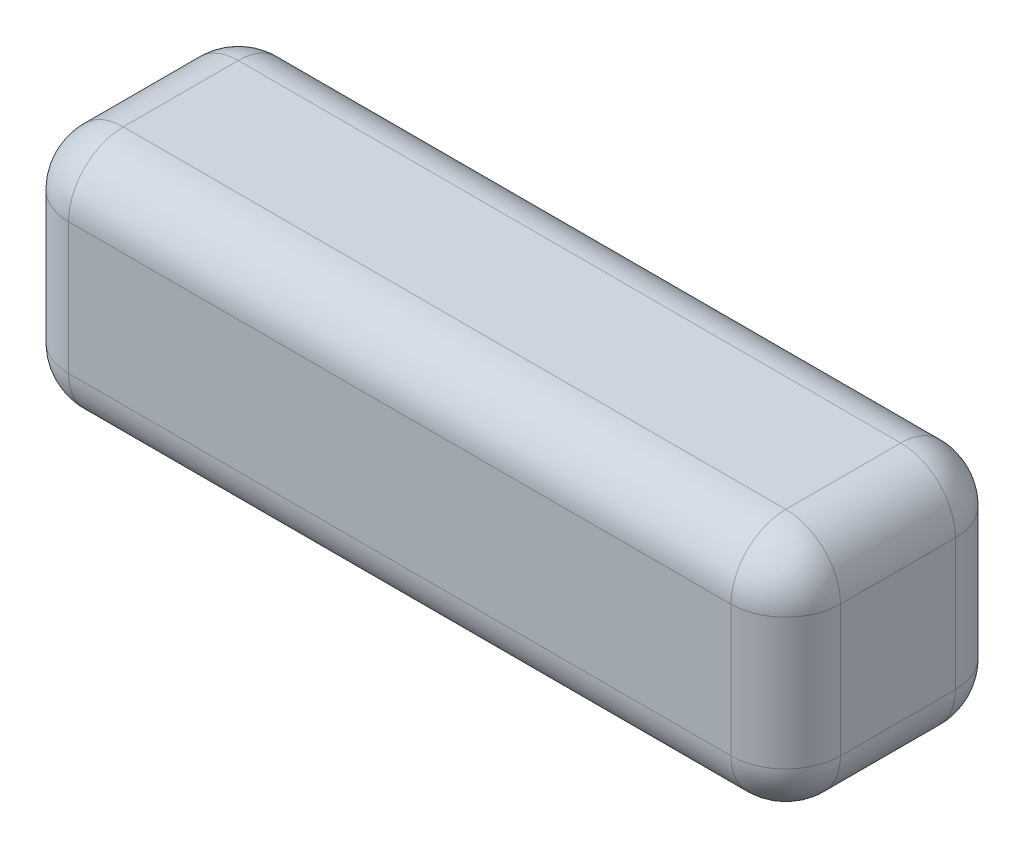
ISO-10303-21;
HEADER;
FILE_DESCRIPTION(('STEP AP214'),'2;1');
FILE_NAME('part.step','',(''),(''),'','','');
FILE_SCHEMA(('AUTOMOTIVE_DESIGN { 1 0 10303 214 1 1 1 1 }'));
ENDSEC;
DATA;
#1=APPLICATION_CONTEXT('core data for automotive mechanical design processes');
#2=APPLICATION_PROTOCOL_DEFINITION('international standard','automotive_design',2000,#1);
#3=PRODUCT_CONTEXT('',#1,'mechanical');
#4=PRODUCT('Part','Part','',(#3));
#5=PRODUCT_RELATED_PRODUCT_CATEGORY('part','',(#4));
#6=PRODUCT_DEFINITION_FORMATION('','',#4);
#7=PRODUCT_DEFINITION_CONTEXT('part definition',#1,'design');
#8=PRODUCT_DEFINITION('design','',#6,#7);
#9=PRODUCT_DEFINITION_SHAPE('','',#8);
#10=(LENGTH_UNIT() NAMED_UNIT(*) SI_UNIT(.MILLI.,.METRE.));
#11=(NAMED_UNIT(*) PLANE_ANGLE_UNIT() SI_UNIT($,.RADIAN.));
#12=(NAMED_UNIT(*) SI_UNIT($,.STERADIAN.) SOLID_ANGLE_UNIT());
#13=UNCERTAINTY_MEASURE_WITH_UNIT(LENGTH_MEASURE(1.E-05),#10,'distance_accuracy_value','');
#14=(GEOMETRIC_REPRESENTATION_CONTEXT(3) GLOBAL_UNCERTAINTY_ASSIGNED_CONTEXT((#13)) GLOBAL_UNIT_ASSIGNED_CONTEXT((#10,
#11,#12)) REPRESENTATION_CONTEXT('',''));
#15=CARTESIAN_POINT('',(0.,0.,0.));
#16=DIRECTION('',(0.,0.,1.));
#17=DIRECTION('',(1.,0.,0.));
#18=AXIS2_PLACEMENT_3D('',#15,#16,#17);
#19=CARTESIAN_POINT('',(-70.4999999999999,44.,-20.5));
#20=DIRECTION('',(1.,0.,0.));
#21=DIRECTION('',(0.,0.,-1.));
#22=AXIS2_PLACEMENT_3D('',#19,#20,#21);
#23=PLANE('',#22);
#24=DIRECTION('',(0.,-1.,0.));
#25=VECTOR('',#24,1.);
#26=CARTESIAN_POINT('',(-70.4999999999999,44.,10.5));
#27=LINE('',#26,#25);
#28=CARTESIAN_POINT('',(-70.4999999999999,10.,10.5));
#29=VERTEX_POINT('',#28);
#30=CARTESIAN_POINT('',(-70.4999999999999,34.,10.5));
#31=VERTEX_POINT('',#30);
#32=EDGE_CURVE('E136',#29,#31,#27,.F.);
#33=ORIENTED_EDGE('',*,*,#32,.T.);
#34=DIRECTION('',(0.,0.,1.));
#35=VECTOR('',#34,1.);
#36=CARTESIAN_POINT('',(-70.4999999999999,34.,-20.5));
#37=LINE('',#36,#35);
#38=CARTESIAN_POINT('',(-70.4999999999999,34.,-10.5));
#39=VERTEX_POINT('',#38);
#40=EDGE_CURVE('E173',#31,#39,#37,.F.);
#41=ORIENTED_EDGE('',*,*,#40,.T.);
#42=DIRECTION('',(0.,-1.,0.));
#43=VECTOR('',#42,1.);
#44=CARTESIAN_POINT('',(-70.4999999999999,44.,-10.5));
#45=LINE('',#44,#43);
#46=CARTESIAN_POINT('',(-70.4999999999999,10.,-10.5));
#47=VERTEX_POINT('',#46);
#48=EDGE_CURVE('E170',#39,#47,#45,.T.);
#49=ORIENTED_EDGE('',*,*,#48,.T.);
#50=DIRECTION('',(0.,0.,1.));
#51=VECTOR('',#50,1.);
#52=CARTESIAN_POINT('',(-70.4999999999999,10.,-20.5));
#53=LINE('',#52,#51);
#54=EDGE_CURVE('E165',#47,#29,#53,.T.);
#55=ORIENTED_EDGE('',*,*,#54,.T.);
#56=EDGE_LOOP('',(#33,#41,#49,#55));
#57=FACE_BOUND('',#56,.T.);
#58=ADVANCED_FACE('F41',(#57),#23,.F.);
#59=CARTESIAN_POINT('',(-70.4999999999999,44.,20.5));
#60=DIRECTION('',(0.,0.,-1.));
#61=DIRECTION('',(-1.,0.,0.));
#62=AXIS2_PLACEMENT_3D('',#59,#60,#61);
#63=PLANE('',#62);
#64=DIRECTION('',(0.,-1.,0.));
#65=VECTOR('',#64,1.);
#66=CARTESIAN_POINT('',(60.5000000000001,44.,20.5));
#67=LINE('',#66,#65);
#68=CARTESIAN_POINT('',(60.5000000000001,10.,20.5));
#69=VERTEX_POINT('',#68);
#70=CARTESIAN_POINT('',(60.5000000000001,34.,20.5));
#71=VERTEX_POINT('',#70);
#72=EDGE_CURVE('E158',#69,#71,#67,.F.);
#73=ORIENTED_EDGE('',*,*,#72,.T.);
#74=DIRECTION('',(1.,0.,0.));
#75=VECTOR('',#74,1.);
#76=CARTESIAN_POINT('',(-70.4999999999999,34.,20.5));
#77=LINE('',#76,#75);
#78=CARTESIAN_POINT('',(-60.4999999999999,34.,20.5));
#79=VERTEX_POINT('',#78);
#80=EDGE_CURVE('E162',#71,#79,#77,.F.);
#81=ORIENTED_EDGE('',*,*,#80,.T.);
#82=DIRECTION('',(0.,-1.,0.));
#83=VECTOR('',#82,1.);
#84=CARTESIAN_POINT('',(-60.4999999999999,44.,20.5));
#85=LINE('',#84,#83);
#86=CARTESIAN_POINT('',(-60.4999999999999,10.,20.5));
#87=VERTEX_POINT('',#86);
#88=EDGE_CURVE('E134',#79,#87,#85,.T.);
#89=ORIENTED_EDGE('',*,*,#88,.T.);
#90=DIRECTION('',(1.,0.,0.));
#91=VECTOR('',#90,1.);
#92=CARTESIAN_POINT('',(-70.4999999999999,10.,20.5));
#93=LINE('',#92,#91);
#94=EDGE_CURVE('E152',#87,#69,#93,.T.);
#95=ORIENTED_EDGE('',*,*,#94,.T.);
#96=EDGE_LOOP('',(#73,#81,#89,#95));
#97=FACE_BOUND('',#96,.T.);
#98=ADVANCED_FACE('F160',(#97),#63,.F.);
#99=CARTESIAN_POINT('',(70.5000000000001,44.,-20.5));
#100=DIRECTION('',(-1.,0.,0.));
#101=DIRECTION('',(0.,0.,1.));
#102=AXIS2_PLACEMENT_3D('',#99,#100,#101);
#103=PLANE('',#102);
#104=DIRECTION('',(0.,-1.,0.));
#105=VECTOR('',#104,1.);
#106=CARTESIAN_POINT('',(70.5000000000001,44.,-10.5));
#107=LINE('',#106,#105);
#108=CARTESIAN_POINT('',(70.5000000000001,10.,-10.5));
#109=VERTEX_POINT('',#108);
#110=CARTESIAN_POINT('',(70.5000000000001,34.,-10.5));
#111=VERTEX_POINT('',#110);
#112=EDGE_CURVE('E177',#109,#111,#107,.F.);
#113=ORIENTED_EDGE('',*,*,#112,.T.);
#114=DIRECTION('',(0.,0.,-1.));
#115=VECTOR('',#114,1.);
#116=CARTESIAN_POINT('',(70.5000000000001,34.,20.5));
#117=LINE('',#116,#115);
#118=CARTESIAN_POINT('',(70.5000000000001,34.,10.5));
#119=VERTEX_POINT('',#118);
#120=EDGE_CURVE('E182',#111,#119,#117,.F.);
#121=ORIENTED_EDGE('',*,*,#120,.T.);
#122=DIRECTION('',(0.,-1.,0.));
#123=VECTOR('',#122,1.);
#124=CARTESIAN_POINT('',(70.5000000000001,44.,10.5));
#125=LINE('',#124,#123);
#126=CARTESIAN_POINT('',(70.5000000000001,10.,10.5));
#127=VERTEX_POINT('',#126);
#128=EDGE_CURVE('E179',#119,#127,#125,.T.);
#129=ORIENTED_EDGE('',*,*,#128,.T.);
#130=DIRECTION('',(0.,0.,-1.));
#131=VECTOR('',#130,1.);
#132=CARTESIAN_POINT('',(70.5000000000001,10.,-20.5));
#133=LINE('',#132,#131);
#134=EDGE_CURVE('E175',#127,#109,#133,.T.);
#135=ORIENTED_EDGE('',*,*,#134,.T.);
#136=EDGE_LOOP('',(#113,#121,#129,#135));
#137=FACE_BOUND('',#136,.T.);
#138=ADVANCED_FACE('F287',(#137),#103,.F.);
#139=CARTESIAN_POINT('',(-70.4999999999999,44.,-20.5));
#140=DIRECTION('',(0.,0.,1.));
#141=DIRECTION('',(1.,0.,0.));
#142=AXIS2_PLACEMENT_3D('',#139,#140,#141);
#143=PLANE('',#142);
#144=DIRECTION('',(0.,-1.,0.));
#145=VECTOR('',#144,1.);
#146=CARTESIAN_POINT('',(-60.4999999999999,44.,-20.5));
#147=LINE('',#146,#145);
#148=CARTESIAN_POINT('',(-60.4999999999999,10.,-20.5));
#149=VERTEX_POINT('',#148);
#150=CARTESIAN_POINT('',(-60.4999999999999,34.,-20.5));
#151=VERTEX_POINT('',#150);
#152=EDGE_CURVE('E186',#149,#151,#147,.F.);
#153=ORIENTED_EDGE('',*,*,#152,.T.);
#154=DIRECTION('',(-1.,0.,0.));
#155=VECTOR('',#154,1.);
#156=CARTESIAN_POINT('',(70.5000000000001,34.,-20.5));
#157=LINE('',#156,#155);
#158=CARTESIAN_POINT('',(60.5000000000001,34.,-20.5));
#159=VERTEX_POINT('',#158);
#160=EDGE_CURVE('E191',#151,#159,#157,.F.);
#161=ORIENTED_EDGE('',*,*,#160,.T.);
#162=DIRECTION('',(0.,-1.,0.));
#163=VECTOR('',#162,1.);
#164=CARTESIAN_POINT('',(60.5000000000001,44.,-20.5));
#165=LINE('',#164,#163);
#166=CARTESIAN_POINT('',(60.5000000000001,10.,-20.5));
#167=VERTEX_POINT('',#166);
#168=EDGE_CURVE('E188',#159,#167,#165,.T.);
#169=ORIENTED_EDGE('',*,*,#168,.T.);
#170=DIRECTION('',(-1.,0.,0.));
#171=VECTOR('',#170,1.);
#172=CARTESIAN_POINT('',(-70.4999999999999,10.,-20.5));
#173=LINE('',#172,#171);
#174=EDGE_CURVE('E184',#167,#149,#173,.T.);
#175=ORIENTED_EDGE('',*,*,#174,.T.);
#176=EDGE_LOOP('',(#153,#161,#169,#175));
#177=FACE_BOUND('',#176,.T.);
#178=ADVANCED_FACE('F297',(#177),#143,.F.);
#179=CARTESIAN_POINT('',(0.,44.,0.));
#180=DIRECTION('',(0.,1.,0.));
#181=DIRECTION('',(0.,0.,1.));
#182=AXIS2_PLACEMENT_3D('',#179,#180,#181);
#183=PLANE('',#182);
#184=DIRECTION('',(0.,0.,-1.));
#185=VECTOR('',#184,1.);
#186=CARTESIAN_POINT('',(60.5000000000001,44.,-20.5));
#187=LINE('',#186,#185);
#188=CARTESIAN_POINT('',(60.5000000000001,44.,10.5));
#189=VERTEX_POINT('',#188);
#190=CARTESIAN_POINT('',(60.5000000000001,44.,-10.5));
#191=VERTEX_POINT('',#190);
#192=EDGE_CURVE('E197',#189,#191,#187,.T.);
#193=ORIENTED_EDGE('',*,*,#192,.T.);
#194=DIRECTION('',(-1.,0.,0.));
#195=VECTOR('',#194,1.);
#196=CARTESIAN_POINT('',(-70.4999999999999,44.,-10.5));
#197=LINE('',#196,#195);
#198=CARTESIAN_POINT('',(-60.4999999999999,44.,-10.5));
#199=VERTEX_POINT('',#198);
#200=EDGE_CURVE('E199',#191,#199,#197,.T.);
#201=ORIENTED_EDGE('',*,*,#200,.T.);
#202=DIRECTION('',(0.,0.,1.));
#203=VECTOR('',#202,1.);
#204=CARTESIAN_POINT('',(-60.4999999999999,44.,20.5));
#205=LINE('',#204,#203);
#206=CARTESIAN_POINT('',(-60.4999999999999,44.,10.5));
#207=VERTEX_POINT('',#206);
#208=EDGE_CURVE('E193',#199,#207,#205,.T.);
#209=ORIENTED_EDGE('',*,*,#208,.T.);
#210=DIRECTION('',(1.,0.,0.));
#211=VECTOR('',#210,1.);
#212=CARTESIAN_POINT('',(70.5000000000001,44.,10.5));
#213=LINE('',#212,#211);
#214=EDGE_CURVE('E195',#207,#189,#213,.T.);
#215=ORIENTED_EDGE('',*,*,#214,.T.);
#216=EDGE_LOOP('',(#193,#201,#209,#215));
#217=FACE_BOUND('',#216,.T.);
#218=ADVANCED_FACE('F279',(#217),#183,.T.);
#219=CARTESIAN_POINT('',(0.,0.,0.));
#220=DIRECTION('',(0.,1.,0.));
#221=DIRECTION('',(0.,0.,1.));
#222=AXIS2_PLACEMENT_3D('',#219,#220,#221);
#223=PLANE('',#222);
#224=DIRECTION('',(0.,0.,1.));
#225=VECTOR('',#224,1.);
#226=CARTESIAN_POINT('',(-60.4999999999999,0.,0.));
#227=LINE('',#226,#225);
#228=CARTESIAN_POINT('',(-60.4999999999999,0.,10.5));
#229=VERTEX_POINT('',#228);
#230=CARTESIAN_POINT('',(-60.4999999999999,0.,-10.5));
#231=VERTEX_POINT('',#230);
#232=EDGE_CURVE('E202',#229,#231,#227,.F.);
#233=ORIENTED_EDGE('',*,*,#232,.T.);
#234=DIRECTION('',(-1.,0.,0.));
#235=VECTOR('',#234,1.);
#236=CARTESIAN_POINT('',(0.,0.,-10.5));
#237=LINE('',#236,#235);
#238=CARTESIAN_POINT('',(60.5000000000001,0.,-10.5));
#239=VERTEX_POINT('',#238);
#240=EDGE_CURVE('E11',#231,#239,#237,.F.);
#241=ORIENTED_EDGE('',*,*,#240,.T.);
#242=DIRECTION('',(0.,0.,-1.));
#243=VECTOR('',#242,1.);
#244=CARTESIAN_POINT('',(60.5000000000001,0.,0.));
#245=LINE('',#244,#243);
#246=CARTESIAN_POINT('',(60.5000000000001,0.,10.5));
#247=VERTEX_POINT('',#246);
#248=EDGE_CURVE('E50',#239,#247,#245,.F.);
#249=ORIENTED_EDGE('',*,*,#248,.T.);
#250=DIRECTION('',(1.,0.,0.));
#251=VECTOR('',#250,1.);
#252=CARTESIAN_POINT('',(0.,0.,10.5));
#253=LINE('',#252,#251);
#254=EDGE_CURVE('E204',#247,#229,#253,.F.);
#255=ORIENTED_EDGE('',*,*,#254,.T.);
#256=EDGE_LOOP('',(#233,#241,#249,#255));
#257=FACE_BOUND('',#256,.T.);
#258=ADVANCED_FACE('F525',(#257),#223,.F.);
#259=CARTESIAN_POINT('',(60.5000000000001,44.,-10.5));
#260=DIRECTION('',(0.,-1.,0.));
#261=DIRECTION('',(0.,0.,-1.));
#262=AXIS2_PLACEMENT_3D('',#259,#260,#261);
#263=CYLINDRICAL_SURFACE('',#262,10.);
#264=CARTESIAN_POINT('',(60.5000000000001,34.,-10.5));
#265=DIRECTION('',(0.,1.,0.));
#266=DIRECTION('',(0.,0.,1.));
#267=AXIS2_PLACEMENT_3D('',#264,#265,#266);
#268=CIRCLE('',#267,10.);
#269=EDGE_CURVE('E45',#111,#159,#268,.T.);
#270=ORIENTED_EDGE('',*,*,#269,.F.);
#271=ORIENTED_EDGE('',*,*,#112,.F.);
#272=CARTESIAN_POINT('',(60.5000000000001,10.,-10.5));
#273=DIRECTION('',(0.,-1.,0.));
#274=DIRECTION('',(0.,0.,-1.));
#275=AXIS2_PLACEMENT_3D('',#272,#273,#274);
#276=CIRCLE('',#275,10.);
#277=EDGE_CURVE('E257',#167,#109,#276,.T.);
#278=ORIENTED_EDGE('',*,*,#277,.F.);
#279=ORIENTED_EDGE('',*,*,#168,.F.);
#280=EDGE_LOOP('',(#270,#271,#278,#279));
#281=FACE_BOUND('',#280,.T.);
#282=ADVANCED_FACE('F43',(#281),#263,.T.);
#283=CARTESIAN_POINT('',(60.5000000000001,34.,-10.5));
#284=DIRECTION('',(0.,0.,-1.));
#285=DIRECTION('',(-1.,0.,0.));
#286=AXIS2_PLACEMENT_3D('',#283,#284,#285);
#287=SPHERICAL_SURFACE('',#286,10.);
#288=CARTESIAN_POINT('',(60.5000000000001,34.,-10.5));
#289=DIRECTION('',(0.,0.,-1.));
#290=DIRECTION('',(-1.,0.,0.));
#291=AXIS2_PLACEMENT_3D('',#288,#289,#290);
#292=CIRCLE('',#291,10.);
#293=EDGE_CURVE('E252',#111,#191,#292,.F.);
#294=ORIENTED_EDGE('',*,*,#293,.F.);
#295=ORIENTED_EDGE('',*,*,#269,.T.);
#296=CARTESIAN_POINT('',(60.5000000000001,34.,-10.5));
#297=DIRECTION('',(1.,0.,0.));
#298=DIRECTION('',(0.,1.,0.));
#299=AXIS2_PLACEMENT_3D('',#296,#297,#298);
#300=CIRCLE('',#299,10.);
#301=EDGE_CURVE('E255',#191,#159,#300,.F.);
#302=ORIENTED_EDGE('',*,*,#301,.F.);
#303=EDGE_LOOP('',(#294,#295,#302));
#304=FACE_BOUND('',#303,.T.);
#305=ADVANCED_FACE('F267',(#304),#287,.T.);
#306=CARTESIAN_POINT('',(60.5000000000001,10.,-10.5));
#307=DIRECTION('',(1.,0.,0.));
#308=DIRECTION('',(0.,1.,0.));
#309=AXIS2_PLACEMENT_3D('',#306,#307,#308);
#310=SPHERICAL_SURFACE('',#309,10.);
#311=CARTESIAN_POINT('',(60.5000000000001,10.,-10.5));
#312=DIRECTION('',(1.,0.,0.));
#313=DIRECTION('',(0.,0.,-1.));
#314=AXIS2_PLACEMENT_3D('',#311,#312,#313);
#315=CIRCLE('',#314,10.);
#316=EDGE_CURVE('E247',#167,#239,#315,.F.);
#317=ORIENTED_EDGE('',*,*,#316,.F.);
#318=ORIENTED_EDGE('',*,*,#277,.T.);
#319=CARTESIAN_POINT('',(60.5000000000001,10.,-10.5));
#320=DIRECTION('',(0.,0.,-1.));
#321=DIRECTION('',(-1.,0.,0.));
#322=AXIS2_PLACEMENT_3D('',#319,#320,#321);
#323=CIRCLE('',#322,10.);
#324=EDGE_CURVE('E250',#239,#109,#323,.F.);
#325=ORIENTED_EDGE('',*,*,#324,.F.);
#326=EDGE_LOOP('',(#317,#318,#325));
#327=FACE_BOUND('',#326,.T.);
#328=ADVANCED_FACE('F498',(#327),#310,.T.);
#329=CARTESIAN_POINT('',(0.,34.,-10.5));
#330=DIRECTION('',(1.,0.,0.));
#331=DIRECTION('',(0.,0.,-1.));
#332=AXIS2_PLACEMENT_3D('',#329,#330,#331);
#333=CYLINDRICAL_SURFACE('',#332,10.);
#334=ORIENTED_EDGE('',*,*,#301,.T.);
#335=ORIENTED_EDGE('',*,*,#160,.F.);
#336=CARTESIAN_POINT('',(-60.4999999999999,34.,-10.5));
#337=DIRECTION('',(-1.,0.,0.));
#338=DIRECTION('',(0.,0.,1.));
#339=AXIS2_PLACEMENT_3D('',#336,#337,#338);
#340=CIRCLE('',#339,10.);
#341=EDGE_CURVE('E241',#199,#151,#340,.T.);
#342=ORIENTED_EDGE('',*,*,#341,.F.);
#343=ORIENTED_EDGE('',*,*,#200,.F.);
#344=EDGE_LOOP('',(#334,#335,#342,#343));
#345=FACE_BOUND('',#344,.T.);
#346=ADVANCED_FACE('F275',(#345),#333,.T.);
#347=CARTESIAN_POINT('',(60.5000000000001,34.,0.));
#348=DIRECTION('',(0.,0.,1.));
#349=DIRECTION('',(1.,0.,0.));
#350=AXIS2_PLACEMENT_3D('',#347,#348,#349);
#351=CYLINDRICAL_SURFACE('',#350,10.);
#352=ORIENTED_EDGE('',*,*,#293,.T.);
#353=ORIENTED_EDGE('',*,*,#192,.F.);
#354=CARTESIAN_POINT('',(60.5000000000001,34.,10.5));
#355=DIRECTION('',(0.,0.,1.));
#356=DIRECTION('',(0.,-1.,0.));
#357=AXIS2_PLACEMENT_3D('',#354,#355,#356);
#358=CIRCLE('',#357,10.);
#359=EDGE_CURVE('E238',#119,#189,#358,.T.);
#360=ORIENTED_EDGE('',*,*,#359,.F.);
#361=ORIENTED_EDGE('',*,*,#120,.F.);
#362=EDGE_LOOP('',(#352,#353,#360,#361));
#363=FACE_BOUND('',#362,.T.);
#364=ADVANCED_FACE('F284',(#363),#351,.T.);
#365=CARTESIAN_POINT('',(60.5000000000001,44.,10.5));
#366=DIRECTION('',(0.,-1.,0.));
#367=DIRECTION('',(0.,0.,-1.));
#368=AXIS2_PLACEMENT_3D('',#365,#366,#367);
#369=CYLINDRICAL_SURFACE('',#368,10.);
#370=CARTESIAN_POINT('',(60.5000000000001,10.,10.5));
#371=DIRECTION('',(0.,-1.,0.));
#372=DIRECTION('',(0.,0.,-1.));
#373=AXIS2_PLACEMENT_3D('',#370,#371,#372);
#374=CIRCLE('',#373,10.);
#375=EDGE_CURVE('E232',#127,#69,#374,.T.);
#376=ORIENTED_EDGE('',*,*,#375,.F.);
#377=ORIENTED_EDGE('',*,*,#128,.F.);
#378=CARTESIAN_POINT('',(60.5000000000001,34.,10.5));
#379=DIRECTION('',(0.,1.,0.));
#380=DIRECTION('',(0.,0.,1.));
#381=AXIS2_PLACEMENT_3D('',#378,#379,#380);
#382=CIRCLE('',#381,10.);
#383=EDGE_CURVE('E235',#71,#119,#382,.T.);
#384=ORIENTED_EDGE('',*,*,#383,.F.);
#385=ORIENTED_EDGE('',*,*,#72,.F.);
#386=EDGE_LOOP('',(#376,#377,#384,#385));
#387=FACE_BOUND('',#386,.T.);
#388=ADVANCED_FACE('F291',(#387),#369,.T.);
#389=CARTESIAN_POINT('',(60.5000000000001,10.,-20.5));
#390=DIRECTION('',(0.,0.,-1.));
#391=DIRECTION('',(-1.,0.,0.));
#392=AXIS2_PLACEMENT_3D('',#389,#390,#391);
#393=CYLINDRICAL_SURFACE('',#392,10.);
#394=ORIENTED_EDGE('',*,*,#324,.T.);
#395=ORIENTED_EDGE('',*,*,#134,.F.);
#396=CARTESIAN_POINT('',(60.5000000000001,10.,10.5));
#397=DIRECTION('',(0.,0.,1.));
#398=DIRECTION('',(1.,0.,0.));
#399=AXIS2_PLACEMENT_3D('',#396,#397,#398);
#400=CIRCLE('',#399,10.);
#401=EDGE_CURVE('E230',#247,#127,#400,.T.);
#402=ORIENTED_EDGE('',*,*,#401,.F.);
#403=ORIENTED_EDGE('',*,*,#248,.F.);
#404=EDGE_LOOP('',(#394,#395,#402,#403));
#405=FACE_BOUND('',#404,.T.);
#406=ADVANCED_FACE('F295',(#405),#393,.T.);
#407=CARTESIAN_POINT('',(-70.4999999999999,10.,-10.5));
#408=DIRECTION('',(-1.,0.,0.));
#409=DIRECTION('',(0.,0.,1.));
#410=AXIS2_PLACEMENT_3D('',#407,#408,#409);
#411=CYLINDRICAL_SURFACE('',#410,10.);
#412=ORIENTED_EDGE('',*,*,#316,.T.);
#413=ORIENTED_EDGE('',*,*,#240,.F.);
#414=CARTESIAN_POINT('',(-60.4999999999999,10.,-10.5));
#415=DIRECTION('',(-1.,0.,0.));
#416=DIRECTION('',(0.,0.,1.));
#417=AXIS2_PLACEMENT_3D('',#414,#415,#416);
#418=CIRCLE('',#417,10.);
#419=EDGE_CURVE('E227',#149,#231,#418,.T.);
#420=ORIENTED_EDGE('',*,*,#419,.F.);
#421=ORIENTED_EDGE('',*,*,#174,.F.);
#422=EDGE_LOOP('',(#412,#413,#420,#421));
#423=FACE_BOUND('',#422,.T.);
#424=ADVANCED_FACE('F307',(#423),#411,.T.);
#425=CARTESIAN_POINT('',(-60.4999999999999,44.,-10.5));
#426=DIRECTION('',(0.,-1.,0.));
#427=DIRECTION('',(0.,0.,-1.));
#428=AXIS2_PLACEMENT_3D('',#425,#426,#427);
#429=CYLINDRICAL_SURFACE('',#428,10.);
#430=CARTESIAN_POINT('',(-60.4999999999999,34.,-10.5));
#431=DIRECTION('',(0.,1.,0.));
#432=DIRECTION('',(0.,0.,1.));
#433=AXIS2_PLACEMENT_3D('',#430,#431,#432);
#434=CIRCLE('',#433,10.);
#435=EDGE_CURVE('E244',#151,#39,#434,.T.);
#436=ORIENTED_EDGE('',*,*,#435,.F.);
#437=ORIENTED_EDGE('',*,*,#152,.F.);
#438=CARTESIAN_POINT('',(-60.4999999999999,10.,-10.5));
#439=DIRECTION('',(0.,-1.,0.));
#440=DIRECTION('',(0.,0.,-1.));
#441=AXIS2_PLACEMENT_3D('',#438,#439,#440);
#442=CIRCLE('',#441,10.);
#443=EDGE_CURVE('E224',#47,#149,#442,.T.);
#444=ORIENTED_EDGE('',*,*,#443,.F.);
#445=ORIENTED_EDGE('',*,*,#48,.F.);
#446=EDGE_LOOP('',(#436,#437,#444,#445));
#447=FACE_BOUND('',#446,.T.);
#448=ADVANCED_FACE('F302',(#447),#429,.T.);
#449=CARTESIAN_POINT('',(-60.4999999999999,34.,-10.5));
#450=DIRECTION('',(0.,0.,-1.));
#451=DIRECTION('',(-1.,0.,0.));
#452=AXIS2_PLACEMENT_3D('',#449,#450,#451);
#453=SPHERICAL_SURFACE('',#452,10.);
#454=ORIENTED_EDGE('',*,*,#341,.T.);
#455=ORIENTED_EDGE('',*,*,#435,.T.);
#456=CARTESIAN_POINT('',(-60.4999999999999,34.,-10.5));
#457=DIRECTION('',(0.,0.,-1.));
#458=DIRECTION('',(-1.,0.,0.));
#459=AXIS2_PLACEMENT_3D('',#456,#457,#458);
#460=CIRCLE('',#459,10.);
#461=EDGE_CURVE('E221',#199,#39,#460,.F.);
#462=ORIENTED_EDGE('',*,*,#461,.F.);
#463=EDGE_LOOP('',(#454,#455,#462));
#464=FACE_BOUND('',#463,.T.);
#465=ADVANCED_FACE('F318',(#464),#453,.T.);
#466=CARTESIAN_POINT('',(60.5000000000001,34.,10.5));
#467=DIRECTION('',(1.,0.,0.));
#468=DIRECTION('',(0.,0.,-1.));
#469=AXIS2_PLACEMENT_3D('',#466,#467,#468);
#470=SPHERICAL_SURFACE('',#469,10.);
#471=ORIENTED_EDGE('',*,*,#383,.T.);
#472=ORIENTED_EDGE('',*,*,#359,.T.);
#473=CARTESIAN_POINT('',(60.5000000000001,34.,10.5));
#474=DIRECTION('',(1.,0.,0.));
#475=DIRECTION('',(0.,0.,-1.));
#476=AXIS2_PLACEMENT_3D('',#473,#474,#475);
#477=CIRCLE('',#476,10.);
#478=EDGE_CURVE('E218',#71,#189,#477,.F.);
#479=ORIENTED_EDGE('',*,*,#478,.F.);
#480=EDGE_LOOP('',(#471,#472,#479));
#481=FACE_BOUND('',#480,.T.);
#482=ADVANCED_FACE('F328',(#481),#470,.T.);
#483=CARTESIAN_POINT('',(60.5000000000001,10.,10.5));
#484=DIRECTION('',(1.,0.,0.));
#485=DIRECTION('',(0.,0.,-1.));
#486=AXIS2_PLACEMENT_3D('',#483,#484,#485);
#487=SPHERICAL_SURFACE('',#486,10.);
#488=ORIENTED_EDGE('',*,*,#401,.T.);
#489=ORIENTED_EDGE('',*,*,#375,.T.);
#490=CARTESIAN_POINT('',(60.5000000000001,10.,10.5));
#491=DIRECTION('',(1.,0.,0.));
#492=DIRECTION('',(0.,0.,-1.));
#493=AXIS2_PLACEMENT_3D('',#490,#491,#492);
#494=CIRCLE('',#493,10.);
#495=EDGE_CURVE('E155',#247,#69,#494,.F.);
#496=ORIENTED_EDGE('',*,*,#495,.F.);
#497=EDGE_LOOP('',(#488,#489,#496));
#498=FACE_BOUND('',#497,.T.);
#499=ADVANCED_FACE('F330',(#498),#487,.T.);
#500=CARTESIAN_POINT('',(-60.4999999999999,10.,-10.5));
#501=DIRECTION('',(0.,0.,-1.));
#502=DIRECTION('',(0.,1.,0.));
#503=AXIS2_PLACEMENT_3D('',#500,#501,#502);
#504=SPHERICAL_SURFACE('',#503,10.);
#505=ORIENTED_EDGE('',*,*,#443,.T.);
#506=ORIENTED_EDGE('',*,*,#419,.T.);
#507=CARTESIAN_POINT('',(-60.4999999999999,10.,-10.5));
#508=DIRECTION('',(0.,0.,-1.));
#509=DIRECTION('',(-1.,0.,0.));
#510=AXIS2_PLACEMENT_3D('',#507,#508,#509);
#511=CIRCLE('',#510,10.);
#512=EDGE_CURVE('E214',#47,#231,#511,.F.);
#513=ORIENTED_EDGE('',*,*,#512,.F.);
#514=EDGE_LOOP('',(#505,#506,#513));
#515=FACE_BOUND('',#514,.T.);
#516=ADVANCED_FACE('F309',(#515),#504,.T.);
#517=CARTESIAN_POINT('',(-60.4999999999999,34.,0.));
#518=DIRECTION('',(0.,0.,-1.));
#519=DIRECTION('',(-1.,0.,0.));
#520=AXIS2_PLACEMENT_3D('',#517,#518,#519);
#521=CYLINDRICAL_SURFACE('',#520,10.);
#522=ORIENTED_EDGE('',*,*,#461,.T.);
#523=ORIENTED_EDGE('',*,*,#40,.F.);
#524=CARTESIAN_POINT('',(-60.4999999999999,34.,10.5));
#525=DIRECTION('',(0.,0.,1.));
#526=DIRECTION('',(1.,0.,0.));
#527=AXIS2_PLACEMENT_3D('',#524,#525,#526);
#528=CIRCLE('',#527,10.);
#529=EDGE_CURVE('E211',#207,#31,#528,.T.);
#530=ORIENTED_EDGE('',*,*,#529,.F.);
#531=ORIENTED_EDGE('',*,*,#208,.F.);
#532=EDGE_LOOP('',(#522,#523,#530,#531));
#533=FACE_BOUND('',#532,.T.);
#534=ADVANCED_FACE('F320',(#533),#521,.T.);
#535=CARTESIAN_POINT('',(0.,34.,10.5));
#536=DIRECTION('',(-1.,0.,0.));
#537=DIRECTION('',(0.,0.,1.));
#538=AXIS2_PLACEMENT_3D('',#535,#536,#537);
#539=CYLINDRICAL_SURFACE('',#538,10.);
#540=ORIENTED_EDGE('',*,*,#478,.T.);
#541=ORIENTED_EDGE('',*,*,#214,.F.);
#542=CARTESIAN_POINT('',(-60.4999999999999,34.,10.5));
#543=DIRECTION('',(-1.,0.,0.));
#544=DIRECTION('',(0.,0.,1.));
#545=AXIS2_PLACEMENT_3D('',#542,#543,#544);
#546=CIRCLE('',#545,10.);
#547=EDGE_CURVE('E149',#79,#207,#546,.T.);
#548=ORIENTED_EDGE('',*,*,#547,.F.);
#549=ORIENTED_EDGE('',*,*,#80,.F.);
#550=EDGE_LOOP('',(#540,#541,#548,#549));
#551=FACE_BOUND('',#550,.T.);
#552=ADVANCED_FACE('F326',(#551),#539,.T.);
#553=CARTESIAN_POINT('',(-70.4999999999999,10.,10.5));
#554=DIRECTION('',(1.,0.,0.));
#555=DIRECTION('',(0.,0.,-1.));
#556=AXIS2_PLACEMENT_3D('',#553,#554,#555);
#557=CYLINDRICAL_SURFACE('',#556,10.);
#558=ORIENTED_EDGE('',*,*,#495,.T.);
#559=ORIENTED_EDGE('',*,*,#94,.F.);
#560=CARTESIAN_POINT('',(-60.4999999999999,10.,10.5));
#561=DIRECTION('',(-1.,0.,0.));
#562=DIRECTION('',(0.,0.,1.));
#563=AXIS2_PLACEMENT_3D('',#560,#561,#562);
#564=CIRCLE('',#563,10.);
#565=EDGE_CURVE('E142',#229,#87,#564,.T.);
#566=ORIENTED_EDGE('',*,*,#565,.F.);
#567=ORIENTED_EDGE('',*,*,#254,.F.);
#568=EDGE_LOOP('',(#558,#559,#566,#567));
#569=FACE_BOUND('',#568,.T.);
#570=ADVANCED_FACE('F153',(#569),#557,.T.);
#571=CARTESIAN_POINT('',(-60.4999999999999,10.,-20.5));
#572=DIRECTION('',(0.,0.,1.));
#573=DIRECTION('',(1.,0.,0.));
#574=AXIS2_PLACEMENT_3D('',#571,#572,#573);
#575=CYLINDRICAL_SURFACE('',#574,10.);
#576=ORIENTED_EDGE('',*,*,#512,.T.);
#577=ORIENTED_EDGE('',*,*,#232,.F.);
#578=CARTESIAN_POINT('',(-60.4999999999999,10.,10.5));
#579=DIRECTION('',(0.,0.,1.));
#580=DIRECTION('',(1.,0.,0.));
#581=AXIS2_PLACEMENT_3D('',#578,#579,#580);
#582=CIRCLE('',#581,10.);
#583=EDGE_CURVE('E146',#29,#229,#582,.T.);
#584=ORIENTED_EDGE('',*,*,#583,.F.);
#585=ORIENTED_EDGE('',*,*,#54,.F.);
#586=EDGE_LOOP('',(#576,#577,#584,#585));
#587=FACE_BOUND('',#586,.T.);
#588=ADVANCED_FACE('F313',(#587),#575,.T.);
#589=CARTESIAN_POINT('',(-60.4999999999999,34.,10.5));
#590=DIRECTION('',(0.,1.,0.));
#591=DIRECTION('',(0.,0.,1.));
#592=AXIS2_PLACEMENT_3D('',#589,#590,#591);
#593=SPHERICAL_SURFACE('',#592,10.);
#594=ORIENTED_EDGE('',*,*,#547,.T.);
#595=ORIENTED_EDGE('',*,*,#529,.T.);
#596=CARTESIAN_POINT('',(-60.4999999999999,34.,10.5));
#597=DIRECTION('',(0.,1.,0.));
#598=DIRECTION('',(0.,0.,1.));
#599=AXIS2_PLACEMENT_3D('',#596,#597,#598);
#600=CIRCLE('',#599,10.);
#601=EDGE_CURVE('E139',#79,#31,#600,.F.);
#602=ORIENTED_EDGE('',*,*,#601,.F.);
#603=EDGE_LOOP('',(#594,#595,#602));
#604=FACE_BOUND('',#603,.T.);
#605=ADVANCED_FACE('F324',(#604),#593,.T.);
#606=CARTESIAN_POINT('',(-60.4999999999999,10.,10.5));
#607=DIRECTION('',(0.,-1.,0.));
#608=DIRECTION('',(0.,0.,-1.));
#609=AXIS2_PLACEMENT_3D('',#606,#607,#608);
#610=SPHERICAL_SURFACE('',#609,10.);
#611=ORIENTED_EDGE('',*,*,#583,.T.);
#612=ORIENTED_EDGE('',*,*,#565,.T.);
#613=CARTESIAN_POINT('',(-60.4999999999999,10.,10.5));
#614=DIRECTION('',(0.,-1.,0.));
#615=DIRECTION('',(0.,0.,-1.));
#616=AXIS2_PLACEMENT_3D('',#613,#614,#615);
#617=CIRCLE('',#616,10.);
#618=EDGE_CURVE('E130',#29,#87,#617,.F.);
#619=ORIENTED_EDGE('',*,*,#618,.F.);
#620=EDGE_LOOP('',(#611,#612,#619));
#621=FACE_BOUND('',#620,.T.);
#622=ADVANCED_FACE('F144',(#621),#610,.T.);
#623=CARTESIAN_POINT('',(-60.4999999999999,44.,10.5));
#624=DIRECTION('',(0.,-1.,0.));
#625=DIRECTION('',(0.,0.,-1.));
#626=AXIS2_PLACEMENT_3D('',#623,#624,#625);
#627=CYLINDRICAL_SURFACE('',#626,10.);
#628=ORIENTED_EDGE('',*,*,#601,.T.);
#629=ORIENTED_EDGE('',*,*,#32,.F.);
#630=ORIENTED_EDGE('',*,*,#618,.T.);
#631=ORIENTED_EDGE('',*,*,#88,.F.);
#632=EDGE_LOOP('',(#628,#629,#630,#631));
#633=FACE_BOUND('',#632,.T.);
#634=ADVANCED_FACE('F132',(#633),#627,.T.);
#635=CLOSED_SHELL('',(#58,#98,#138,#178,#218,#258,#282,#305,#328,#346,#364,#388,#406,#424,#448,
#465,#482,#499,#516,#534,#552,#570,#588,#605,#622,#634));
#636=MANIFOLD_SOLID_BREP('B2',#635);
#637=ADVANCED_BREP_SHAPE_REPRESENTATION('',(#18,#636),#14);
#638=SHAPE_DEFINITION_REPRESENTATION(#9,#637);
ENDSEC;
END-ISO-10303-21;
